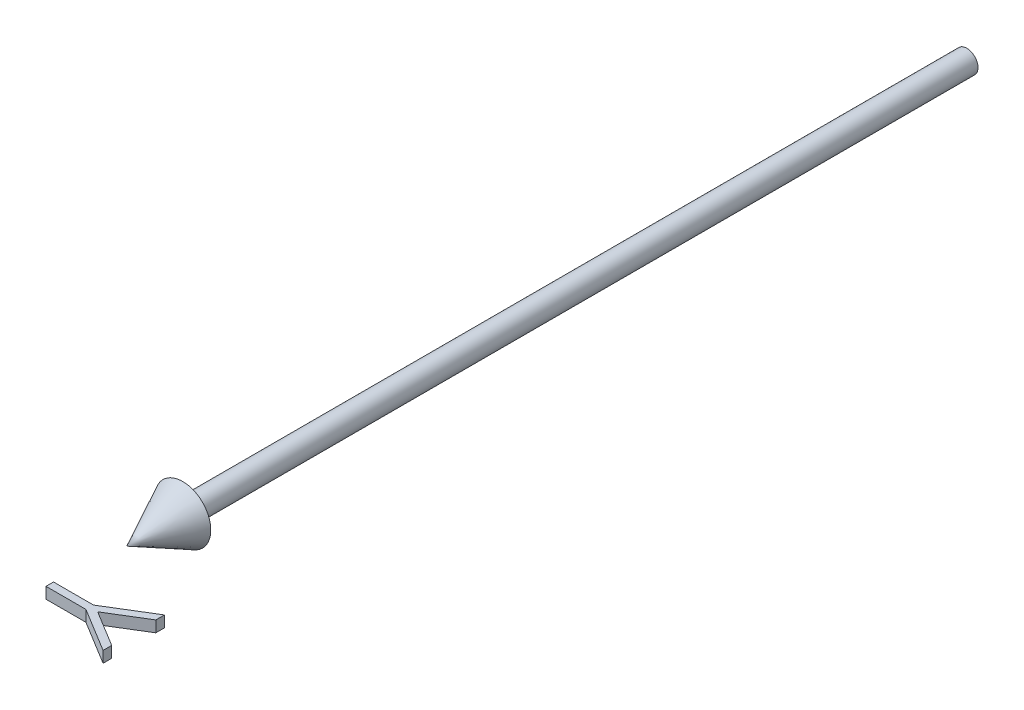
ISO-10303-21;
HEADER;
FILE_DESCRIPTION(('STEP AP214'),'2;1');
FILE_NAME('part.step','',(''),(''),'','','');
FILE_SCHEMA(('AUTOMOTIVE_DESIGN { 1 0 10303 214 1 1 1 1 }'));
ENDSEC;
DATA;
#1=APPLICATION_CONTEXT('core data for automotive mechanical design processes');
#2=APPLICATION_PROTOCOL_DEFINITION('international standard','automotive_design',2000,#1);
#3=PRODUCT_CONTEXT('',#1,'mechanical');
#4=PRODUCT('Part','Part','',(#3));
#5=PRODUCT_RELATED_PRODUCT_CATEGORY('part','',(#4));
#6=PRODUCT_DEFINITION_FORMATION('','',#4);
#7=PRODUCT_DEFINITION_CONTEXT('part definition',#1,'design');
#8=PRODUCT_DEFINITION('design','',#6,#7);
#9=PRODUCT_DEFINITION_SHAPE('','',#8);
#10=(LENGTH_UNIT() NAMED_UNIT(*) SI_UNIT(.MILLI.,.METRE.));
#11=(NAMED_UNIT(*) PLANE_ANGLE_UNIT() SI_UNIT($,.RADIAN.));
#12=(NAMED_UNIT(*) SI_UNIT($,.STERADIAN.) SOLID_ANGLE_UNIT());
#13=UNCERTAINTY_MEASURE_WITH_UNIT(LENGTH_MEASURE(1.E-05),#10,'distance_accuracy_value','');
#14=(GEOMETRIC_REPRESENTATION_CONTEXT(3) GLOBAL_UNCERTAINTY_ASSIGNED_CONTEXT((#13)) GLOBAL_UNIT_ASSIGNED_CONTEXT((#10,
#11,#12)) REPRESENTATION_CONTEXT('',''));
#15=CARTESIAN_POINT('',(0.,0.,0.));
#16=DIRECTION('',(0.,0.,1.));
#17=DIRECTION('',(1.,0.,0.));
#18=AXIS2_PLACEMENT_3D('',#15,#16,#17);
#19=CARTESIAN_POINT('',(7.13040865384615,1.,163.076923076923));
#20=DIRECTION('',(-0.521331386880885,0.,-0.853354313900652));
#21=DIRECTION('',(-0.853354313900652,0.,0.521331386880885));
#22=AXIS2_PLACEMENT_3D('',#19,#20,#21);
#23=PLANE('',#22);
#24=DIRECTION('',(0.,-1.,0.));
#25=VECTOR('',#24,1.);
#26=CARTESIAN_POINT('',(15.,1.,158.269230769231));
#27=LINE('',#26,#25);
#28=CARTESIAN_POINT('',(15.,1.,158.269230769231));
#29=VERTEX_POINT('',#28);
#30=CARTESIAN_POINT('',(15.,-1.,158.269230769231));
#31=VERTEX_POINT('',#30);
#32=EDGE_CURVE('E52',#29,#31,#27,.T.);
#33=ORIENTED_EDGE('',*,*,#32,.T.);
#34=DIRECTION('',(0.853354313900652,0.,-0.521331386880885));
#35=VECTOR('',#34,1.);
#36=CARTESIAN_POINT('',(7.13040865384615,-1.,163.076923076923));
#37=LINE('',#36,#35);
#38=CARTESIAN_POINT('',(7.13040865384615,-1.,163.076923076923));
#39=VERTEX_POINT('',#38);
#40=EDGE_CURVE('E119',#39,#31,#37,.T.);
#41=ORIENTED_EDGE('',*,*,#40,.F.);
#42=DIRECTION('',(0.,-1.,0.));
#43=VECTOR('',#42,1.);
#44=CARTESIAN_POINT('',(7.13040865384615,1.,163.076923076923));
#45=LINE('',#44,#43);
#46=CARTESIAN_POINT('',(7.13040865384615,1.,163.076923076923));
#47=VERTEX_POINT('',#46);
#48=EDGE_CURVE('E12',#47,#39,#45,.T.);
#49=ORIENTED_EDGE('',*,*,#48,.F.);
#50=DIRECTION('',(0.853354313900652,0.,-0.521331386880885));
#51=VECTOR('',#50,1.);
#52=CARTESIAN_POINT('',(7.13040865384615,1.,163.076923076923));
#53=LINE('',#52,#51);
#54=EDGE_CURVE('E120',#47,#29,#53,.T.);
#55=ORIENTED_EDGE('',*,*,#54,.T.);
#56=EDGE_LOOP('',(#33,#41,#49,#55));
#57=FACE_BOUND('',#56,.T.);
#58=ADVANCED_FACE('F49',(#57),#23,.T.);
#59=CARTESIAN_POINT('',(0.,1.,163.076923076923));
#60=DIRECTION('',(0.,0.,-1.));
#61=DIRECTION('',(-1.,0.,0.));
#62=AXIS2_PLACEMENT_3D('',#59,#60,#61);
#63=PLANE('',#62);
#64=ORIENTED_EDGE('',*,*,#48,.T.);
#65=DIRECTION('',(1.,0.,0.));
#66=VECTOR('',#65,1.);
#67=CARTESIAN_POINT('',(0.,-1.,163.076923076923));
#68=LINE('',#67,#66);
#69=CARTESIAN_POINT('',(0.,-1.,163.076923076923));
#70=VERTEX_POINT('',#69);
#71=EDGE_CURVE('E137',#70,#39,#68,.T.);
#72=ORIENTED_EDGE('',*,*,#71,.F.);
#73=DIRECTION('',(0.,-1.,0.));
#74=VECTOR('',#73,1.);
#75=CARTESIAN_POINT('',(0.,1.,163.076923076923));
#76=LINE('',#75,#74);
#77=CARTESIAN_POINT('',(0.,1.,163.076923076923));
#78=VERTEX_POINT('',#77);
#79=EDGE_CURVE('E57',#78,#70,#76,.T.);
#80=ORIENTED_EDGE('',*,*,#79,.F.);
#81=DIRECTION('',(1.,0.,0.));
#82=VECTOR('',#81,1.);
#83=CARTESIAN_POINT('',(0.,1.,163.076923076923));
#84=LINE('',#83,#82);
#85=EDGE_CURVE('E125',#78,#47,#84,.T.);
#86=ORIENTED_EDGE('',*,*,#85,.T.);
#87=EDGE_LOOP('',(#64,#72,#80,#86));
#88=FACE_BOUND('',#87,.T.);
#89=ADVANCED_FACE('F213',(#88),#63,.T.);
#90=CARTESIAN_POINT('',(0.,1.,164.423076923077));
#91=DIRECTION('',(-1.,0.,0.));
#92=DIRECTION('',(0.,0.,1.));
#93=AXIS2_PLACEMENT_3D('',#90,#91,#92);
#94=PLANE('',#93);
#95=ORIENTED_EDGE('',*,*,#79,.T.);
#96=DIRECTION('',(0.,0.,-1.));
#97=VECTOR('',#96,1.);
#98=CARTESIAN_POINT('',(0.,-1.,164.423076923077));
#99=LINE('',#98,#97);
#100=CARTESIAN_POINT('',(0.,-1.,164.423076923077));
#101=VERTEX_POINT('',#100);
#102=EDGE_CURVE('E153',#101,#70,#99,.T.);
#103=ORIENTED_EDGE('',*,*,#102,.F.);
#104=DIRECTION('',(0.,-1.,0.));
#105=VECTOR('',#104,1.);
#106=CARTESIAN_POINT('',(0.,1.,164.423076923077));
#107=LINE('',#106,#105);
#108=CARTESIAN_POINT('',(0.,1.,164.423076923077));
#109=VERTEX_POINT('',#108);
#110=EDGE_CURVE('E178',#109,#101,#107,.T.);
#111=ORIENTED_EDGE('',*,*,#110,.F.);
#112=DIRECTION('',(0.,0.,-1.));
#113=VECTOR('',#112,1.);
#114=CARTESIAN_POINT('',(0.,1.,164.423076923077));
#115=LINE('',#114,#113);
#116=EDGE_CURVE('E174',#109,#78,#115,.T.);
#117=ORIENTED_EDGE('',*,*,#116,.T.);
#118=EDGE_LOOP('',(#95,#103,#111,#117));
#119=FACE_BOUND('',#118,.T.);
#120=ADVANCED_FACE('F211',(#119),#94,.T.);
#121=CARTESIAN_POINT('',(7.13040865384615,1.,164.423076923077));
#122=DIRECTION('',(0.,0.,1.));
#123=DIRECTION('',(1.,0.,0.));
#124=AXIS2_PLACEMENT_3D('',#121,#122,#123);
#125=PLANE('',#124);
#126=ORIENTED_EDGE('',*,*,#110,.T.);
#127=DIRECTION('',(-1.,0.,0.));
#128=VECTOR('',#127,1.);
#129=CARTESIAN_POINT('',(7.13040865384615,-1.,164.423076923077));
#130=LINE('',#129,#128);
#131=CARTESIAN_POINT('',(7.13040865384615,-1.,164.423076923077));
#132=VERTEX_POINT('',#131);
#133=EDGE_CURVE('E150',#132,#101,#130,.T.);
#134=ORIENTED_EDGE('',*,*,#133,.F.);
#135=DIRECTION('',(0.,-1.,0.));
#136=VECTOR('',#135,1.);
#137=CARTESIAN_POINT('',(7.13040865384615,1.,164.423076923077));
#138=LINE('',#137,#136);
#139=CARTESIAN_POINT('',(7.13040865384615,1.,164.423076923077));
#140=VERTEX_POINT('',#139);
#141=EDGE_CURVE('E180',#140,#132,#138,.T.);
#142=ORIENTED_EDGE('',*,*,#141,.F.);
#143=DIRECTION('',(-1.,0.,0.));
#144=VECTOR('',#143,1.);
#145=CARTESIAN_POINT('',(7.13040865384615,1.,164.423076923077));
#146=LINE('',#145,#144);
#147=EDGE_CURVE('E171',#140,#109,#146,.T.);
#148=ORIENTED_EDGE('',*,*,#147,.T.);
#149=EDGE_LOOP('',(#126,#134,#142,#148));
#150=FACE_BOUND('',#149,.T.);
#151=ADVANCED_FACE('F209',(#150),#125,.T.);
#152=CARTESIAN_POINT('',(15.,1.,169.230769230769));
#153=DIRECTION('',(-0.521331386880888,0.,0.853354313900651));
#154=DIRECTION('',(0.853354313900651,0.,0.521331386880888));
#155=AXIS2_PLACEMENT_3D('',#152,#153,#154);
#156=PLANE('',#155);
#157=ORIENTED_EDGE('',*,*,#141,.T.);
#158=DIRECTION('',(-0.853354313900651,0.,-0.521331386880888));
#159=VECTOR('',#158,1.);
#160=CARTESIAN_POINT('',(15.,-1.,169.230769230769));
#161=LINE('',#160,#159);
#162=CARTESIAN_POINT('',(15.,-1.,169.230769230769));
#163=VERTEX_POINT('',#162);
#164=EDGE_CURVE('E147',#163,#132,#161,.T.);
#165=ORIENTED_EDGE('',*,*,#164,.F.);
#166=DIRECTION('',(0.,-1.,0.));
#167=VECTOR('',#166,1.);
#168=CARTESIAN_POINT('',(15.,1.,169.230769230769));
#169=LINE('',#168,#167);
#170=CARTESIAN_POINT('',(15.,1.,169.230769230769));
#171=VERTEX_POINT('',#170);
#172=EDGE_CURVE('E182',#171,#163,#169,.T.);
#173=ORIENTED_EDGE('',*,*,#172,.F.);
#174=DIRECTION('',(-0.853354313900651,0.,-0.521331386880888));
#175=VECTOR('',#174,1.);
#176=CARTESIAN_POINT('',(15.,1.,169.230769230769));
#177=LINE('',#176,#175);
#178=EDGE_CURVE('E168',#171,#140,#177,.T.);
#179=ORIENTED_EDGE('',*,*,#178,.T.);
#180=EDGE_LOOP('',(#157,#165,#173,#179));
#181=FACE_BOUND('',#180,.T.);
#182=ADVANCED_FACE('F204',(#181),#156,.T.);
#183=CARTESIAN_POINT('',(15.,1.,167.689302884615));
#184=DIRECTION('',(1.,0.,0.));
#185=DIRECTION('',(0.,0.,-1.));
#186=AXIS2_PLACEMENT_3D('',#183,#184,#185);
#187=PLANE('',#186);
#188=ORIENTED_EDGE('',*,*,#172,.T.);
#189=DIRECTION('',(0.,0.,1.));
#190=VECTOR('',#189,1.);
#191=CARTESIAN_POINT('',(15.,-1.,167.689302884615));
#192=LINE('',#191,#190);
#193=CARTESIAN_POINT('',(15.,-1.,167.689302884615));
#194=VERTEX_POINT('',#193);
#195=EDGE_CURVE('E144',#194,#163,#192,.T.);
#196=ORIENTED_EDGE('',*,*,#195,.F.);
#197=DIRECTION('',(0.,-1.,0.));
#198=VECTOR('',#197,1.);
#199=CARTESIAN_POINT('',(15.,1.,167.689302884615));
#200=LINE('',#199,#198);
#201=CARTESIAN_POINT('',(15.,1.,167.689302884615));
#202=VERTEX_POINT('',#201);
#203=EDGE_CURVE('E184',#202,#194,#200,.T.);
#204=ORIENTED_EDGE('',*,*,#203,.F.);
#205=DIRECTION('',(0.,0.,1.));
#206=VECTOR('',#205,1.);
#207=CARTESIAN_POINT('',(15.,1.,167.689302884615));
#208=LINE('',#207,#206);
#209=EDGE_CURVE('E165',#202,#171,#208,.T.);
#210=ORIENTED_EDGE('',*,*,#209,.T.);
#211=EDGE_LOOP('',(#188,#196,#204,#210));
#212=FACE_BOUND('',#211,.T.);
#213=ADVANCED_FACE('F197',(#212),#187,.T.);
#214=CARTESIAN_POINT('',(8.5546875,1.,163.753004807692));
#215=DIRECTION('',(0.52120858483258,0.,-0.853429324019757));
#216=DIRECTION('',(-0.853429324019757,0.,-0.52120858483258));
#217=AXIS2_PLACEMENT_3D('',#214,#215,#216);
#218=PLANE('',#217);
#219=ORIENTED_EDGE('',*,*,#203,.T.);
#220=DIRECTION('',(0.853429324019757,0.,0.52120858483258));
#221=VECTOR('',#220,1.);
#222=CARTESIAN_POINT('',(8.5546875,-1.,163.753004807692));
#223=LINE('',#222,#221);
#224=CARTESIAN_POINT('',(8.5546875,-1.,163.753004807692));
#225=VERTEX_POINT('',#224);
#226=EDGE_CURVE('E141',#225,#194,#223,.T.);
#227=ORIENTED_EDGE('',*,*,#226,.F.);
#228=DIRECTION('',(0.,-1.,0.));
#229=VECTOR('',#228,1.);
#230=CARTESIAN_POINT('',(8.5546875,1.,163.753004807692));
#231=LINE('',#230,#229);
#232=CARTESIAN_POINT('',(8.5546875,1.,163.753004807692));
#233=VERTEX_POINT('',#232);
#234=EDGE_CURVE('E186',#233,#225,#231,.T.);
#235=ORIENTED_EDGE('',*,*,#234,.F.);
#236=DIRECTION('',(0.853429324019757,0.,0.52120858483258));
#237=VECTOR('',#236,1.);
#238=CARTESIAN_POINT('',(8.5546875,1.,163.753004807692));
#239=LINE('',#238,#237);
#240=EDGE_CURVE('E162',#233,#202,#239,.T.);
#241=ORIENTED_EDGE('',*,*,#240,.T.);
#242=EDGE_LOOP('',(#219,#227,#235,#241));
#243=FACE_BOUND('',#242,.T.);
#244=ADVANCED_FACE('F194',(#243),#218,.T.);
#245=CARTESIAN_POINT('',(15.,1.,159.810697115385));
#246=DIRECTION('',(0.521787793651244,0.,0.853075318126463));
#247=DIRECTION('',(0.853075318126463,0.,-0.521787793651244));
#248=AXIS2_PLACEMENT_3D('',#245,#246,#247);
#249=PLANE('',#248);
#250=ORIENTED_EDGE('',*,*,#234,.T.);
#251=DIRECTION('',(-0.853075318126463,0.,0.521787793651244));
#252=VECTOR('',#251,1.);
#253=CARTESIAN_POINT('',(15.,-1.,159.810697115385));
#254=LINE('',#253,#252);
#255=CARTESIAN_POINT('',(15.,-1.,159.810697115385));
#256=VERTEX_POINT('',#255);
#257=EDGE_CURVE('E132',#256,#225,#254,.T.);
#258=ORIENTED_EDGE('',*,*,#257,.F.);
#259=DIRECTION('',(0.,-1.,0.));
#260=VECTOR('',#259,1.);
#261=CARTESIAN_POINT('',(15.,1.,159.810697115385));
#262=LINE('',#261,#260);
#263=CARTESIAN_POINT('',(15.,1.,159.810697115385));
#264=VERTEX_POINT('',#263);
#265=EDGE_CURVE('E124',#264,#256,#262,.T.);
#266=ORIENTED_EDGE('',*,*,#265,.F.);
#267=DIRECTION('',(-0.853075318126463,0.,0.521787793651244));
#268=VECTOR('',#267,1.);
#269=CARTESIAN_POINT('',(15.,1.,159.810697115385));
#270=LINE('',#269,#268);
#271=EDGE_CURVE('E159',#264,#233,#270,.T.);
#272=ORIENTED_EDGE('',*,*,#271,.T.);
#273=EDGE_LOOP('',(#250,#258,#266,#272));
#274=FACE_BOUND('',#273,.T.);
#275=ADVANCED_FACE('F188',(#274),#249,.T.);
#276=CARTESIAN_POINT('',(15.,1.,158.269230769231));
#277=DIRECTION('',(1.,0.,0.));
#278=DIRECTION('',(0.,0.,-1.));
#279=AXIS2_PLACEMENT_3D('',#276,#277,#278);
#280=PLANE('',#279);
#281=ORIENTED_EDGE('',*,*,#265,.T.);
#282=DIRECTION('',(0.,0.,1.));
#283=VECTOR('',#282,1.);
#284=CARTESIAN_POINT('',(15.,-1.,158.269230769231));
#285=LINE('',#284,#283);
#286=EDGE_CURVE('E127',#31,#256,#285,.T.);
#287=ORIENTED_EDGE('',*,*,#286,.F.);
#288=ORIENTED_EDGE('',*,*,#32,.F.);
#289=DIRECTION('',(0.,0.,1.));
#290=VECTOR('',#289,1.);
#291=CARTESIAN_POINT('',(15.,1.,158.269230769231));
#292=LINE('',#291,#290);
#293=EDGE_CURVE('E157',#29,#264,#292,.T.);
#294=ORIENTED_EDGE('',*,*,#293,.T.);
#295=EDGE_LOOP('',(#281,#287,#288,#294));
#296=FACE_BOUND('',#295,.T.);
#297=ADVANCED_FACE('F128',(#296),#280,.T.);
#298=CARTESIAN_POINT('',(0.,1.,0.));
#299=DIRECTION('',(0.,1.,0.));
#300=DIRECTION('',(0.,0.,1.));
#301=AXIS2_PLACEMENT_3D('',#298,#299,#300);
#302=PLANE('',#301);
#303=ORIENTED_EDGE('',*,*,#54,.F.);
#304=ORIENTED_EDGE('',*,*,#85,.F.);
#305=ORIENTED_EDGE('',*,*,#116,.F.);
#306=ORIENTED_EDGE('',*,*,#147,.F.);
#307=ORIENTED_EDGE('',*,*,#178,.F.);
#308=ORIENTED_EDGE('',*,*,#209,.F.);
#309=ORIENTED_EDGE('',*,*,#240,.F.);
#310=ORIENTED_EDGE('',*,*,#271,.F.);
#311=ORIENTED_EDGE('',*,*,#293,.F.);
#312=EDGE_LOOP('',(#303,#304,#305,#306,#307,#308,#309,#310,#311));
#313=FACE_BOUND('',#312,.T.);
#314=ADVANCED_FACE('F200',(#313),#302,.T.);
#315=CARTESIAN_POINT('',(0.,-1.,0.));
#316=DIRECTION('',(0.,1.,0.));
#317=DIRECTION('',(0.,0.,1.));
#318=AXIS2_PLACEMENT_3D('',#315,#316,#317);
#319=PLANE('',#318);
#320=ORIENTED_EDGE('',*,*,#40,.T.);
#321=ORIENTED_EDGE('',*,*,#286,.T.);
#322=ORIENTED_EDGE('',*,*,#257,.T.);
#323=ORIENTED_EDGE('',*,*,#226,.T.);
#324=ORIENTED_EDGE('',*,*,#195,.T.);
#325=ORIENTED_EDGE('',*,*,#164,.T.);
#326=ORIENTED_EDGE('',*,*,#133,.T.);
#327=ORIENTED_EDGE('',*,*,#102,.T.);
#328=ORIENTED_EDGE('',*,*,#71,.T.);
#329=EDGE_LOOP('',(#320,#321,#322,#323,#324,#325,#326,#327,#328));
#330=FACE_BOUND('',#329,.T.);
#331=ADVANCED_FACE('F135',(#330),#319,.F.);
#332=CLOSED_SHELL('',(#58,#89,#120,#151,#182,#213,#244,#275,#297,#314,#331));
#333=MANIFOLD_SOLID_BREP('B2',#332);
#334=CARTESIAN_POINT('',(2.,0.,0.));
#335=DIRECTION('',(0.,0.,1.));
#336=DIRECTION('',(1.,0.,0.));
#337=AXIS2_PLACEMENT_3D('',#334,#335,#336);
#338=PLANE('',#337);
#339=CARTESIAN_POINT('',(0.,0.,0.));
#340=DIRECTION('',(0.,0.,-1.));
#341=DIRECTION('',(-1.,0.,0.));
#342=AXIS2_PLACEMENT_3D('',#339,#340,#341);
#343=CIRCLE('',#342,2.);
#344=CARTESIAN_POINT('',(-2.,0.,0.));
#345=VERTEX_POINT('',#344);
#346=EDGE_CURVE('E47',#345,#345,#343,.T.);
#347=ORIENTED_EDGE('',*,*,#346,.T.);
#348=EDGE_LOOP('',(#347));
#349=FACE_BOUND('',#348,.T.);
#350=ADVANCED_FACE('F303',(#349),#338,.F.);
#351=CARTESIAN_POINT('',(0.,0.,-41.9499520246458));
#352=DIRECTION('',(0.,0.,-1.));
#353=DIRECTION('',(-1.,0.,0.));
#354=AXIS2_PLACEMENT_3D('',#351,#352,#353);
#355=CYLINDRICAL_SURFACE('',#354,2.);
#356=ORIENTED_EDGE('',*,*,#346,.F.);
#357=EDGE_LOOP('',(#356));
#358=FACE_BOUND('',#357,.T.);
#359=CARTESIAN_POINT('',(0.,0.,140.));
#360=DIRECTION('',(0.,0.,-1.));
#361=DIRECTION('',(-1.,0.,0.));
#362=AXIS2_PLACEMENT_3D('',#359,#360,#361);
#363=CIRCLE('',#362,2.);
#364=CARTESIAN_POINT('',(-2.,0.,140.));
#365=VERTEX_POINT('',#364);
#366=EDGE_CURVE('E309',#365,#365,#363,.T.);
#367=ORIENTED_EDGE('',*,*,#366,.T.);
#368=EDGE_LOOP('',(#367));
#369=FACE_BOUND('',#368,.T.);
#370=ADVANCED_FACE('F320',(#358,#369),#355,.T.);
#371=CARTESIAN_POINT('',(5.00000000000002,0.,140.));
#372=DIRECTION('',(0.,0.,1.));
#373=DIRECTION('',(1.,0.,0.));
#374=AXIS2_PLACEMENT_3D('',#371,#372,#373);
#375=PLANE('',#374);
#376=ORIENTED_EDGE('',*,*,#366,.F.);
#377=EDGE_LOOP('',(#376));
#378=FACE_BOUND('',#377,.T.);
#379=CARTESIAN_POINT('',(0.,0.,140.));
#380=DIRECTION('',(0.,0.,-1.));
#381=DIRECTION('',(-1.,0.,0.));
#382=AXIS2_PLACEMENT_3D('',#379,#380,#381);
#383=CIRCLE('',#382,5.00000000000002);
#384=CARTESIAN_POINT('',(-5.00000000000002,0.,140.));
#385=VERTEX_POINT('',#384);
#386=EDGE_CURVE('E334',#385,#385,#383,.T.);
#387=ORIENTED_EDGE('',*,*,#386,.T.);
#388=EDGE_LOOP('',(#387));
#389=FACE_BOUND('',#388,.T.);
#390=ADVANCED_FACE('F314',(#378,#389),#375,.F.);
#391=CARTESIAN_POINT('',(0.,0.,150.));
#392=DIRECTION('',(0.,0.,-1.));
#393=DIRECTION('',(-1.,0.,0.));
#394=AXIS2_PLACEMENT_3D('',#391,#392,#393);
#395=CONICAL_SURFACE('',#394,0.,0.463647609000806);
#396=ORIENTED_EDGE('',*,*,#386,.F.);
#397=EDGE_LOOP('',(#396));
#398=FACE_BOUND('',#397,.T.);
#399=CARTESIAN_POINT('',(0.,0.,150.));
#400=VERTEX_POINT('',#399);
#401=VERTEX_LOOP('',#400);
#402=FACE_BOUND('',#401,.T.);
#403=ADVANCED_FACE('F312',(#398,#402),#395,.T.);
#404=CLOSED_SHELL('',(#350,#370,#390,#403));
#405=MANIFOLD_SOLID_BREP('B6',#404);
#406=ADVANCED_BREP_SHAPE_REPRESENTATION('',(#18,#333,#405),#14);
#407=SHAPE_DEFINITION_REPRESENTATION(#9,#406);
ENDSEC;
END-ISO-10303-21;
